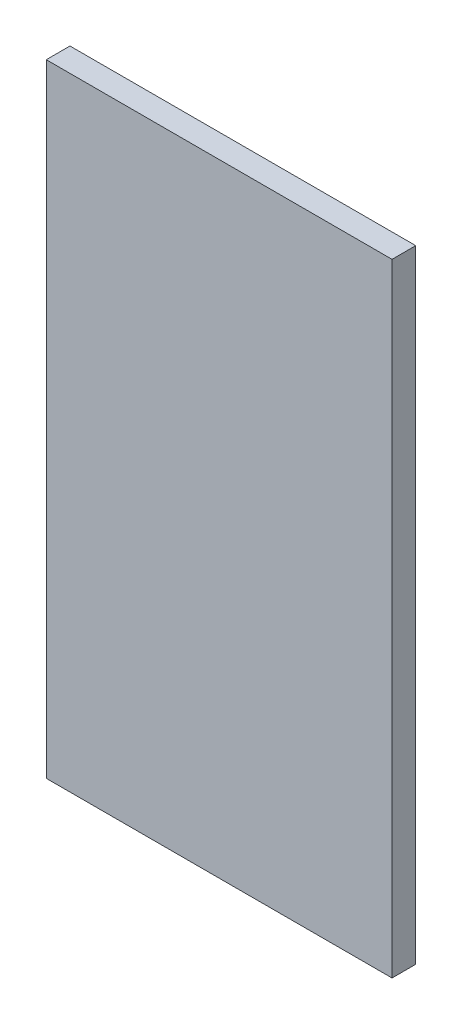
ISO-10303-21;
HEADER;
FILE_DESCRIPTION(('STEP AP214'),'2;1');
FILE_NAME('part.step','',(''),(''),'','','');
FILE_SCHEMA(('AUTOMOTIVE_DESIGN { 1 0 10303 214 1 1 1 1 }'));
ENDSEC;
DATA;
#1=APPLICATION_CONTEXT('core data for automotive mechanical design processes');
#2=APPLICATION_PROTOCOL_DEFINITION('international standard','automotive_design',2000,#1);
#3=PRODUCT_CONTEXT('',#1,'mechanical');
#4=PRODUCT('Part','Part','',(#3));
#5=PRODUCT_RELATED_PRODUCT_CATEGORY('part','',(#4));
#6=PRODUCT_DEFINITION_FORMATION('','',#4);
#7=PRODUCT_DEFINITION_CONTEXT('part definition',#1,'design');
#8=PRODUCT_DEFINITION('design','',#6,#7);
#9=PRODUCT_DEFINITION_SHAPE('','',#8);
#10=(LENGTH_UNIT() NAMED_UNIT(*) SI_UNIT(.MILLI.,.METRE.));
#11=(NAMED_UNIT(*) PLANE_ANGLE_UNIT() SI_UNIT($,.RADIAN.));
#12=(NAMED_UNIT(*) SI_UNIT($,.STERADIAN.) SOLID_ANGLE_UNIT());
#13=UNCERTAINTY_MEASURE_WITH_UNIT(LENGTH_MEASURE(1.E-05),#10,'distance_accuracy_value','');
#14=(GEOMETRIC_REPRESENTATION_CONTEXT(3) GLOBAL_UNCERTAINTY_ASSIGNED_CONTEXT((#13)) GLOBAL_UNIT_ASSIGNED_CONTEXT((#10,
#11,#12)) REPRESENTATION_CONTEXT('',''));
#15=CARTESIAN_POINT('',(0.,0.,0.));
#16=DIRECTION('',(0.,0.,1.));
#17=DIRECTION('',(1.,0.,0.));
#18=AXIS2_PLACEMENT_3D('',#15,#16,#17);
#19=CARTESIAN_POINT('',(3.40008,0.7,0.));
#20=DIRECTION('',(0.,0.,-1.));
#21=DIRECTION('',(-1.,0.,0.));
#22=AXIS2_PLACEMENT_3D('',#19,#20,#21);
#23=PLANE('',#22);
#24=DIRECTION('',(1.,0.,0.));
#25=VECTOR('',#24,1.);
#26=CARTESIAN_POINT('',(3.15008,1.15,0.));
#27=LINE('',#26,#25);
#28=CARTESIAN_POINT('',(3.15008,1.15,0.));
#29=VERTEX_POINT('',#28);
#30=CARTESIAN_POINT('',(3.65008,1.15,0.));
#31=VERTEX_POINT('',#30);
#32=EDGE_CURVE('E55',#29,#31,#27,.T.);
#33=ORIENTED_EDGE('',*,*,#32,.T.);
#34=DIRECTION('',(0.,1.,0.));
#35=VECTOR('',#34,1.);
#36=CARTESIAN_POINT('',(3.65008,1.15,0.));
#37=LINE('',#36,#35);
#38=CARTESIAN_POINT('',(3.65008,0.25,0.));
#39=VERTEX_POINT('',#38);
#40=EDGE_CURVE('E57',#31,#39,#37,.F.);
#41=ORIENTED_EDGE('',*,*,#40,.T.);
#42=DIRECTION('',(1.,0.,0.));
#43=VECTOR('',#42,1.);
#44=CARTESIAN_POINT('',(3.65008,0.25,0.));
#45=LINE('',#44,#43);
#46=CARTESIAN_POINT('',(3.15008,0.25,0.));
#47=VERTEX_POINT('',#46);
#48=EDGE_CURVE('E20',#39,#47,#45,.F.);
#49=ORIENTED_EDGE('',*,*,#48,.T.);
#50=DIRECTION('',(0.,1.,0.));
#51=VECTOR('',#50,1.);
#52=CARTESIAN_POINT('',(3.15008,0.25,0.));
#53=LINE('',#52,#51);
#54=EDGE_CURVE('E80',#47,#29,#53,.T.);
#55=ORIENTED_EDGE('',*,*,#54,.T.);
#56=EDGE_LOOP('',(#33,#41,#49,#55));
#57=FACE_BOUND('',#56,.T.);
#58=ADVANCED_FACE('F17',(#57),#23,.T.);
#59=CARTESIAN_POINT('',(3.65008,0.25,0.));
#60=DIRECTION('',(0.,1.,0.));
#61=DIRECTION('',(0.,0.,1.));
#62=AXIS2_PLACEMENT_3D('',#59,#60,#61);
#63=PLANE('',#62);
#64=DIRECTION('',(0.,0.,-1.));
#65=VECTOR('',#64,1.);
#66=CARTESIAN_POINT('',(3.15008,0.25,0.));
#67=LINE('',#66,#65);
#68=CARTESIAN_POINT('',(3.15008,0.25,0.03429));
#69=VERTEX_POINT('',#68);
#70=EDGE_CURVE('E68',#69,#47,#67,.T.);
#71=ORIENTED_EDGE('',*,*,#70,.T.);
#72=ORIENTED_EDGE('',*,*,#48,.F.);
#73=DIRECTION('',(0.,0.,1.));
#74=VECTOR('',#73,1.);
#75=CARTESIAN_POINT('',(3.65008,0.25,0.));
#76=LINE('',#75,#74);
#77=CARTESIAN_POINT('',(3.65008,0.25,0.03429));
#78=VERTEX_POINT('',#77);
#79=EDGE_CURVE('E63',#39,#78,#76,.T.);
#80=ORIENTED_EDGE('',*,*,#79,.T.);
#81=DIRECTION('',(1.,0.,0.));
#82=VECTOR('',#81,1.);
#83=CARTESIAN_POINT('',(3.40008,0.25,0.03429));
#84=LINE('',#83,#82);
#85=EDGE_CURVE('E83',#69,#78,#84,.T.);
#86=ORIENTED_EDGE('',*,*,#85,.F.);
#87=EDGE_LOOP('',(#71,#72,#80,#86));
#88=FACE_BOUND('',#87,.T.);
#89=ADVANCED_FACE('F65',(#88),#63,.F.);
#90=CARTESIAN_POINT('',(3.65008,1.15,0.));
#91=DIRECTION('',(-1.,0.,0.));
#92=DIRECTION('',(0.,0.,1.));
#93=AXIS2_PLACEMENT_3D('',#90,#91,#92);
#94=PLANE('',#93);
#95=ORIENTED_EDGE('',*,*,#79,.F.);
#96=ORIENTED_EDGE('',*,*,#40,.F.);
#97=DIRECTION('',(0.,0.,-1.));
#98=VECTOR('',#97,1.);
#99=CARTESIAN_POINT('',(3.65008,1.15,0.));
#100=LINE('',#99,#98);
#101=CARTESIAN_POINT('',(3.65008,1.15,0.03429));
#102=VERTEX_POINT('',#101);
#103=EDGE_CURVE('E75',#31,#102,#100,.F.);
#104=ORIENTED_EDGE('',*,*,#103,.T.);
#105=DIRECTION('',(0.,1.,0.));
#106=VECTOR('',#105,1.);
#107=CARTESIAN_POINT('',(3.65008,0.7,0.03429));
#108=LINE('',#107,#106);
#109=EDGE_CURVE('E72',#78,#102,#108,.T.);
#110=ORIENTED_EDGE('',*,*,#109,.F.);
#111=EDGE_LOOP('',(#95,#96,#104,#110));
#112=FACE_BOUND('',#111,.T.);
#113=ADVANCED_FACE('F70',(#112),#94,.F.);
#114=CARTESIAN_POINT('',(3.15008,1.15,0.));
#115=DIRECTION('',(0.,-1.,0.));
#116=DIRECTION('',(0.,0.,-1.));
#117=AXIS2_PLACEMENT_3D('',#114,#115,#116);
#118=PLANE('',#117);
#119=ORIENTED_EDGE('',*,*,#103,.F.);
#120=ORIENTED_EDGE('',*,*,#32,.F.);
#121=DIRECTION('',(0.,0.,-1.));
#122=VECTOR('',#121,1.);
#123=CARTESIAN_POINT('',(3.15008,1.15,0.));
#124=LINE('',#123,#122);
#125=CARTESIAN_POINT('',(3.15008,1.15,0.03429));
#126=VERTEX_POINT('',#125);
#127=EDGE_CURVE('E35',#29,#126,#124,.F.);
#128=ORIENTED_EDGE('',*,*,#127,.T.);
#129=DIRECTION('',(1.,0.,0.));
#130=VECTOR('',#129,1.);
#131=CARTESIAN_POINT('',(3.40008,1.15,0.03429));
#132=LINE('',#131,#130);
#133=EDGE_CURVE('E26',#102,#126,#132,.F.);
#134=ORIENTED_EDGE('',*,*,#133,.F.);
#135=EDGE_LOOP('',(#119,#120,#128,#134));
#136=FACE_BOUND('',#135,.T.);
#137=ADVANCED_FACE('F89',(#136),#118,.F.);
#138=CARTESIAN_POINT('',(3.15008,0.25,0.));
#139=DIRECTION('',(1.,0.,0.));
#140=DIRECTION('',(0.,0.,-1.));
#141=AXIS2_PLACEMENT_3D('',#138,#139,#140);
#142=PLANE('',#141);
#143=ORIENTED_EDGE('',*,*,#127,.F.);
#144=ORIENTED_EDGE('',*,*,#54,.F.);
#145=ORIENTED_EDGE('',*,*,#70,.F.);
#146=DIRECTION('',(0.,1.,0.));
#147=VECTOR('',#146,1.);
#148=CARTESIAN_POINT('',(3.15008,0.7,0.03429));
#149=LINE('',#148,#147);
#150=EDGE_CURVE('E11',#126,#69,#149,.F.);
#151=ORIENTED_EDGE('',*,*,#150,.F.);
#152=EDGE_LOOP('',(#143,#144,#145,#151));
#153=FACE_BOUND('',#152,.T.);
#154=ADVANCED_FACE('F91',(#153),#142,.F.);
#155=CARTESIAN_POINT('',(3.40008,0.7,0.03429));
#156=DIRECTION('',(0.,0.,1.));
#157=DIRECTION('',(1.,0.,0.));
#158=AXIS2_PLACEMENT_3D('',#155,#156,#157);
#159=PLANE('',#158);
#160=ORIENTED_EDGE('',*,*,#133,.T.);
#161=ORIENTED_EDGE('',*,*,#150,.T.);
#162=ORIENTED_EDGE('',*,*,#85,.T.);
#163=ORIENTED_EDGE('',*,*,#109,.T.);
#164=EDGE_LOOP('',(#160,#161,#162,#163));
#165=FACE_BOUND('',#164,.T.);
#166=ADVANCED_FACE('F88',(#165),#159,.T.);
#167=CLOSED_SHELL('',(#58,#89,#113,#137,#154,#166));
#168=MANIFOLD_SOLID_BREP('B1',#167);
#169=ADVANCED_BREP_SHAPE_REPRESENTATION('',(#18,#168),#14);
#170=SHAPE_DEFINITION_REPRESENTATION(#9,#169);
ENDSEC;
END-ISO-10303-21;
